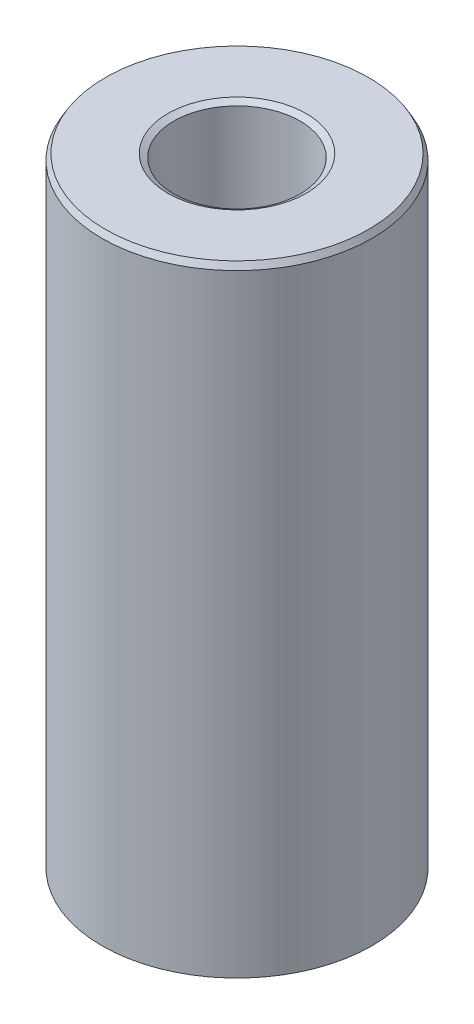
ISO-10303-21;
HEADER;
FILE_DESCRIPTION(('STEP AP214'),'2;1');
FILE_NAME('part.step','',(''),(''),'','','');
FILE_SCHEMA(('AUTOMOTIVE_DESIGN { 1 0 10303 214 1 1 1 1 }'));
ENDSEC;
DATA;
#1=APPLICATION_CONTEXT('core data for automotive mechanical design processes');
#2=APPLICATION_PROTOCOL_DEFINITION('international standard','automotive_design',2000,#1);
#3=PRODUCT_CONTEXT('',#1,'mechanical');
#4=PRODUCT('Part','Part','',(#3));
#5=PRODUCT_RELATED_PRODUCT_CATEGORY('part','',(#4));
#6=PRODUCT_DEFINITION_FORMATION('','',#4);
#7=PRODUCT_DEFINITION_CONTEXT('part definition',#1,'design');
#8=PRODUCT_DEFINITION('design','',#6,#7);
#9=PRODUCT_DEFINITION_SHAPE('','',#8);
#10=(LENGTH_UNIT() NAMED_UNIT(*) SI_UNIT(.MILLI.,.METRE.));
#11=(NAMED_UNIT(*) PLANE_ANGLE_UNIT() SI_UNIT($,.RADIAN.));
#12=(NAMED_UNIT(*) SI_UNIT($,.STERADIAN.) SOLID_ANGLE_UNIT());
#13=UNCERTAINTY_MEASURE_WITH_UNIT(LENGTH_MEASURE(1.E-05),#10,'distance_accuracy_value','');
#14=(GEOMETRIC_REPRESENTATION_CONTEXT(3) GLOBAL_UNCERTAINTY_ASSIGNED_CONTEXT((#13)) GLOBAL_UNIT_ASSIGNED_CONTEXT((#10,
#11,#12)) REPRESENTATION_CONTEXT('',''));
#15=CARTESIAN_POINT('',(0.,0.,0.));
#16=DIRECTION('',(0.,0.,1.));
#17=DIRECTION('',(1.,0.,0.));
#18=AXIS2_PLACEMENT_3D('',#15,#16,#17);
#19=CARTESIAN_POINT('',(0.,230.293208266996,0.));
#20=DIRECTION('',(0.,-1.,0.));
#21=DIRECTION('',(0.,0.,-1.));
#22=AXIS2_PLACEMENT_3D('',#19,#20,#21);
#23=CYLINDRICAL_SURFACE('',#22,50.);
#24=CARTESIAN_POINT('',(0.,1.28493643648542,0.));
#25=DIRECTION('',(0.,1.,0.));
#26=DIRECTION('',(0.,0.,1.));
#27=AXIS2_PLACEMENT_3D('',#24,#25,#26);
#28=CIRCLE('',#27,50.);
#29=CARTESIAN_POINT('',(0.,1.28493643648542,50.));
#30=VERTEX_POINT('',#29);
#31=EDGE_CURVE('E10',#30,#30,#28,.T.);
#32=ORIENTED_EDGE('',*,*,#31,.T.);
#33=EDGE_LOOP('',(#32));
#34=FACE_BOUND('',#33,.T.);
#35=CARTESIAN_POINT('',(0.,228.067633074507,0.));
#36=DIRECTION('',(0.,1.,0.));
#37=DIRECTION('',(0.,0.,1.));
#38=AXIS2_PLACEMENT_3D('',#35,#36,#37);
#39=CIRCLE('',#38,50.);
#40=CARTESIAN_POINT('',(0.,228.067633074507,50.));
#41=VERTEX_POINT('',#40);
#42=EDGE_CURVE('E50',#41,#41,#39,.F.);
#43=ORIENTED_EDGE('',*,*,#42,.T.);
#44=EDGE_LOOP('',(#43));
#45=FACE_BOUND('',#44,.T.);
#46=ADVANCED_FACE('F39',(#34,#45),#23,.T.);
#47=CARTESIAN_POINT('',(0.,230.293208266996,0.));
#48=DIRECTION('',(0.,1.,0.));
#49=DIRECTION('',(0.,0.,1.));
#50=AXIS2_PLACEMENT_3D('',#47,#48,#49);
#51=PLANE('',#50);
#52=CARTESIAN_POINT('',(0.,230.293208266996,0.));
#53=DIRECTION('',(0.,1.,0.));
#54=DIRECTION('',(0.,0.,1.));
#55=AXIS2_PLACEMENT_3D('',#52,#53,#54);
#56=CIRCLE('',#55,25.6057298723532);
#57=CARTESIAN_POINT('',(0.,230.293208266996,25.6057298723532));
#58=VERTEX_POINT('',#57);
#59=EDGE_CURVE('E58',#58,#58,#56,.F.);
#60=ORIENTED_EDGE('',*,*,#59,.T.);
#61=EDGE_LOOP('',(#60));
#62=FACE_BOUND('',#61,.T.);
#63=CARTESIAN_POINT('',(0.,230.293208266996,0.));
#64=DIRECTION('',(0.,1.,0.));
#65=DIRECTION('',(0.,0.,1.));
#66=AXIS2_PLACEMENT_3D('',#63,#64,#65);
#67=CIRCLE('',#66,48.7150635635146);
#68=CARTESIAN_POINT('',(0.,230.293208266996,48.7150635635146));
#69=VERTEX_POINT('',#68);
#70=EDGE_CURVE('E61',#69,#69,#67,.T.);
#71=ORIENTED_EDGE('',*,*,#70,.T.);
#72=EDGE_LOOP('',(#71));
#73=FACE_BOUND('',#72,.T.);
#74=ADVANCED_FACE('F88',(#62,#73),#51,.T.);
#75=CARTESIAN_POINT('',(0.,0.,0.));
#76=DIRECTION('',(0.,1.,0.));
#77=DIRECTION('',(0.,0.,1.));
#78=AXIS2_PLACEMENT_3D('',#75,#76,#77);
#79=PLANE('',#78);
#80=CARTESIAN_POINT('',(0.,0.,0.));
#81=DIRECTION('',(0.,1.,0.));
#82=DIRECTION('',(0.,0.,1.));
#83=AXIS2_PLACEMENT_3D('',#80,#81,#82);
#84=CIRCLE('',#83,24.6650911163493);
#85=CARTESIAN_POINT('',(0.,0.,24.6650911163493));
#86=VERTEX_POINT('',#85);
#87=EDGE_CURVE('E51',#86,#86,#84,.T.);
#88=ORIENTED_EDGE('',*,*,#87,.T.);
#89=EDGE_LOOP('',(#88));
#90=FACE_BOUND('',#89,.T.);
#91=CARTESIAN_POINT('',(0.,0.,0.));
#92=DIRECTION('',(0.,1.,0.));
#93=DIRECTION('',(0.,0.,1.));
#94=AXIS2_PLACEMENT_3D('',#91,#92,#93);
#95=CIRCLE('',#94,47.7744248075108);
#96=CARTESIAN_POINT('',(0.,0.,47.7744248075108));
#97=VERTEX_POINT('',#96);
#98=EDGE_CURVE('E54',#97,#97,#95,.F.);
#99=ORIENTED_EDGE('',*,*,#98,.T.);
#100=EDGE_LOOP('',(#99));
#101=FACE_BOUND('',#100,.T.);
#102=ADVANCED_FACE('F83',(#90,#101),#79,.F.);
#103=CARTESIAN_POINT('',(0.,230.293208266996,0.));
#104=DIRECTION('',(0.,-1.,0.));
#105=DIRECTION('',(0.,0.,-1.));
#106=AXIS2_PLACEMENT_3D('',#103,#104,#105);
#107=CYLINDRICAL_SURFACE('',#106,23.3801546798639);
#108=CARTESIAN_POINT('',(0.,229.008271830511,0.));
#109=DIRECTION('',(0.,1.,0.));
#110=DIRECTION('',(0.,0.,1.));
#111=AXIS2_PLACEMENT_3D('',#108,#109,#110);
#112=CIRCLE('',#111,23.3801546798639);
#113=CARTESIAN_POINT('',(0.,229.008271830511,23.3801546798639));
#114=VERTEX_POINT('',#113);
#115=EDGE_CURVE('E67',#114,#114,#112,.T.);
#116=ORIENTED_EDGE('',*,*,#115,.T.);
#117=EDGE_LOOP('',(#116));
#118=FACE_BOUND('',#117,.T.);
#119=CARTESIAN_POINT('',(0.,2.22557519248931,0.));
#120=DIRECTION('',(0.,1.,0.));
#121=DIRECTION('',(0.,0.,1.));
#122=AXIS2_PLACEMENT_3D('',#119,#120,#121);
#123=CIRCLE('',#122,23.3801546798639);
#124=CARTESIAN_POINT('',(0.,2.22557519248931,23.3801546798639));
#125=VERTEX_POINT('',#124);
#126=EDGE_CURVE('E69',#125,#125,#123,.F.);
#127=ORIENTED_EDGE('',*,*,#126,.T.);
#128=EDGE_LOOP('',(#127));
#129=FACE_BOUND('',#128,.T.);
#130=ADVANCED_FACE('F71',(#118,#129),#107,.F.);
#131=CARTESIAN_POINT('',(0.,229.008271830511,0.));
#132=DIRECTION('',(0.,1.,0.));
#133=DIRECTION('',(0.,0.,1.));
#134=AXIS2_PLACEMENT_3D('',#131,#132,#133);
#135=CONICAL_SURFACE('',#134,23.3801546798639,1.04719755119659);
#136=ORIENTED_EDGE('',*,*,#59,.F.);
#137=EDGE_LOOP('',(#136));
#138=FACE_BOUND('',#137,.T.);
#139=ORIENTED_EDGE('',*,*,#115,.F.);
#140=EDGE_LOOP('',(#139));
#141=FACE_BOUND('',#140,.T.);
#142=ADVANCED_FACE('F77',(#138,#141),#135,.F.);
#143=CARTESIAN_POINT('',(0.,0.,0.));
#144=DIRECTION('',(0.,-1.,0.));
#145=DIRECTION('',(0.,0.,-1.));
#146=AXIS2_PLACEMENT_3D('',#143,#144,#145);
#147=CONICAL_SURFACE('',#146,24.6650911163493,0.523598775598292);
#148=ORIENTED_EDGE('',*,*,#126,.F.);
#149=EDGE_LOOP('',(#148));
#150=FACE_BOUND('',#149,.T.);
#151=ORIENTED_EDGE('',*,*,#87,.F.);
#152=EDGE_LOOP('',(#151));
#153=FACE_BOUND('',#152,.T.);
#154=ADVANCED_FACE('F73',(#150,#153),#147,.F.);
#155=CARTESIAN_POINT('',(0.,1.28493643648542,0.));
#156=DIRECTION('',(0.,1.,0.));
#157=DIRECTION('',(0.,0.,1.));
#158=AXIS2_PLACEMENT_3D('',#155,#156,#157);
#159=CONICAL_SURFACE('',#158,50.,1.04719755119659);
#160=ORIENTED_EDGE('',*,*,#98,.F.);
#161=EDGE_LOOP('',(#160));
#162=FACE_BOUND('',#161,.T.);
#163=ORIENTED_EDGE('',*,*,#31,.F.);
#164=EDGE_LOOP('',(#163));
#165=FACE_BOUND('',#164,.T.);
#166=ADVANCED_FACE('F76',(#162,#165),#159,.T.);
#167=CARTESIAN_POINT('',(0.,230.293208266996,0.));
#168=DIRECTION('',(0.,-1.,0.));
#169=DIRECTION('',(0.,0.,-1.));
#170=AXIS2_PLACEMENT_3D('',#167,#168,#169);
#171=CONICAL_SURFACE('',#170,48.7150635635146,0.523598775598296);
#172=ORIENTED_EDGE('',*,*,#42,.F.);
#173=EDGE_LOOP('',(#172));
#174=FACE_BOUND('',#173,.T.);
#175=ORIENTED_EDGE('',*,*,#70,.F.);
#176=EDGE_LOOP('',(#175));
#177=FACE_BOUND('',#176,.T.);
#178=ADVANCED_FACE('F45',(#174,#177),#171,.T.);
#179=CLOSED_SHELL('',(#46,#74,#102,#130,#142,#154,#166,#178));
#180=MANIFOLD_SOLID_BREP('B2',#179);
#181=ADVANCED_BREP_SHAPE_REPRESENTATION('',(#18,#180),#14);
#182=SHAPE_DEFINITION_REPRESENTATION(#9,#181);
ENDSEC;
END-ISO-10303-21;
